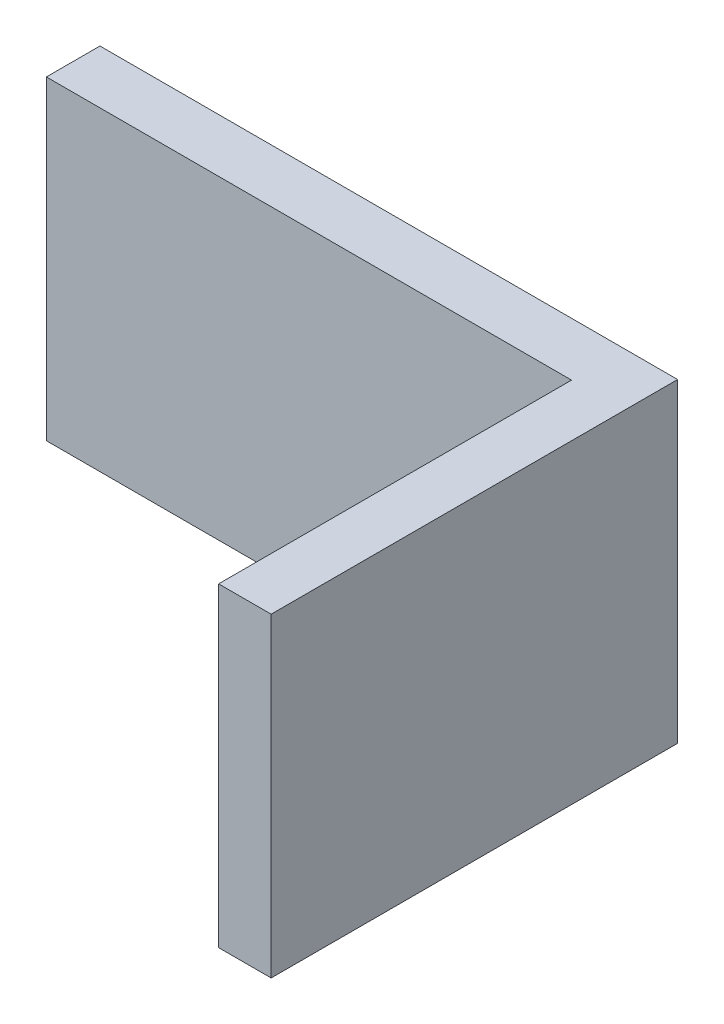
ISO-10303-21;
HEADER;
FILE_DESCRIPTION(('STEP AP214'),'2;1');
FILE_NAME('part.step','',(''),(''),'','','');
FILE_SCHEMA(('AUTOMOTIVE_DESIGN { 1 0 10303 214 1 1 1 1 }'));
ENDSEC;
DATA;
#1=APPLICATION_CONTEXT('core data for automotive mechanical design processes');
#2=APPLICATION_PROTOCOL_DEFINITION('international standard','automotive_design',2000,#1);
#3=PRODUCT_CONTEXT('',#1,'mechanical');
#4=PRODUCT('Part','Part','',(#3));
#5=PRODUCT_RELATED_PRODUCT_CATEGORY('part','',(#4));
#6=PRODUCT_DEFINITION_FORMATION('','',#4);
#7=PRODUCT_DEFINITION_CONTEXT('part definition',#1,'design');
#8=PRODUCT_DEFINITION('design','',#6,#7);
#9=PRODUCT_DEFINITION_SHAPE('','',#8);
#10=(LENGTH_UNIT() NAMED_UNIT(*) SI_UNIT(.MILLI.,.METRE.));
#11=(NAMED_UNIT(*) PLANE_ANGLE_UNIT() SI_UNIT($,.RADIAN.));
#12=(NAMED_UNIT(*) SI_UNIT($,.STERADIAN.) SOLID_ANGLE_UNIT());
#13=UNCERTAINTY_MEASURE_WITH_UNIT(LENGTH_MEASURE(1.E-05),#10,'distance_accuracy_value','');
#14=(GEOMETRIC_REPRESENTATION_CONTEXT(3) GLOBAL_UNCERTAINTY_ASSIGNED_CONTEXT((#13)) GLOBAL_UNIT_ASSIGNED_CONTEXT((#10,
#11,#12)) REPRESENTATION_CONTEXT('',''));
#15=CARTESIAN_POINT('',(0.,0.,0.));
#16=DIRECTION('',(0.,0.,1.));
#17=DIRECTION('',(1.,0.,0.));
#18=AXIS2_PLACEMENT_3D('',#15,#16,#17);
#19=CARTESIAN_POINT('',(4.55,-3.1,0.));
#20=DIRECTION('',(0.,1.,0.));
#21=DIRECTION('',(0.,0.,1.));
#22=AXIS2_PLACEMENT_3D('',#19,#20,#21);
#23=PLANE('',#22);
#24=DIRECTION('',(1.,0.,0.));
#25=VECTOR('',#24,1.);
#26=CARTESIAN_POINT('',(4.,-3.1,0.));
#27=LINE('',#26,#25);
#28=CARTESIAN_POINT('',(4.,-3.1,0.));
#29=VERTEX_POINT('',#28);
#30=CARTESIAN_POINT('',(4.55,-3.1,0.));
#31=VERTEX_POINT('',#30);
#32=EDGE_CURVE('E11',#29,#31,#27,.T.);
#33=ORIENTED_EDGE('',*,*,#32,.F.);
#34=DIRECTION('',(0.,0.,-1.));
#35=VECTOR('',#34,1.);
#36=CARTESIAN_POINT('',(4.,-3.1,0.051));
#37=LINE('',#36,#35);
#38=CARTESIAN_POINT('',(4.,-3.1,0.051));
#39=VERTEX_POINT('',#38);
#40=EDGE_CURVE('E24',#39,#29,#37,.T.);
#41=ORIENTED_EDGE('',*,*,#40,.F.);
#42=DIRECTION('',(-1.,0.,0.));
#43=VECTOR('',#42,1.);
#44=CARTESIAN_POINT('',(4.5,-3.1,0.051));
#45=LINE('',#44,#43);
#46=CARTESIAN_POINT('',(4.5,-3.1,0.051));
#47=VERTEX_POINT('',#46);
#48=EDGE_CURVE('E87',#47,#39,#45,.T.);
#49=ORIENTED_EDGE('',*,*,#48,.F.);
#50=DIRECTION('',(0.,0.,-1.));
#51=VECTOR('',#50,1.);
#52=CARTESIAN_POINT('',(4.5,-3.1,0.387));
#53=LINE('',#52,#51);
#54=CARTESIAN_POINT('',(4.5,-3.1,0.387));
#55=VERTEX_POINT('',#54);
#56=EDGE_CURVE('E114',#55,#47,#53,.T.);
#57=ORIENTED_EDGE('',*,*,#56,.F.);
#58=DIRECTION('',(-1.,0.,0.));
#59=VECTOR('',#58,1.);
#60=CARTESIAN_POINT('',(4.55,-3.1,0.387));
#61=LINE('',#60,#59);
#62=CARTESIAN_POINT('',(4.55,-3.1,0.387));
#63=VERTEX_POINT('',#62);
#64=EDGE_CURVE('E111',#63,#55,#61,.T.);
#65=ORIENTED_EDGE('',*,*,#64,.F.);
#66=DIRECTION('',(0.,0.,1.));
#67=VECTOR('',#66,1.);
#68=CARTESIAN_POINT('',(4.55,-3.1,0.));
#69=LINE('',#68,#67);
#70=EDGE_CURVE('E108',#31,#63,#69,.T.);
#71=ORIENTED_EDGE('',*,*,#70,.F.);
#72=EDGE_LOOP('',(#33,#41,#49,#57,#65,#71));
#73=FACE_BOUND('',#72,.T.);
#74=ADVANCED_FACE('F17',(#73),#23,.T.);
#75=CARTESIAN_POINT('',(4.,-3.4,0.));
#76=DIRECTION('',(0.,-1.,0.));
#77=DIRECTION('',(0.,0.,1.));
#78=AXIS2_PLACEMENT_3D('',#75,#76,#77);
#79=PLANE('',#78);
#80=DIRECTION('',(-1.,0.,0.));
#81=VECTOR('',#80,1.);
#82=CARTESIAN_POINT('',(4.55,-3.4,0.));
#83=LINE('',#82,#81);
#84=CARTESIAN_POINT('',(4.55,-3.4,0.));
#85=VERTEX_POINT('',#84);
#86=CARTESIAN_POINT('',(4.,-3.4,0.));
#87=VERTEX_POINT('',#86);
#88=EDGE_CURVE('E106',#85,#87,#83,.T.);
#89=ORIENTED_EDGE('',*,*,#88,.F.);
#90=DIRECTION('',(0.,0.,-1.));
#91=VECTOR('',#90,1.);
#92=CARTESIAN_POINT('',(4.55,-3.4,0.387));
#93=LINE('',#92,#91);
#94=CARTESIAN_POINT('',(4.55,-3.4,0.387));
#95=VERTEX_POINT('',#94);
#96=EDGE_CURVE('E103',#95,#85,#93,.T.);
#97=ORIENTED_EDGE('',*,*,#96,.F.);
#98=DIRECTION('',(1.,0.,0.));
#99=VECTOR('',#98,1.);
#100=CARTESIAN_POINT('',(4.5,-3.4,0.387));
#101=LINE('',#100,#99);
#102=CARTESIAN_POINT('',(4.5,-3.4,0.387));
#103=VERTEX_POINT('',#102);
#104=EDGE_CURVE('E100',#103,#95,#101,.T.);
#105=ORIENTED_EDGE('',*,*,#104,.F.);
#106=DIRECTION('',(0.,0.,1.));
#107=VECTOR('',#106,1.);
#108=CARTESIAN_POINT('',(4.5,-3.4,0.051));
#109=LINE('',#108,#107);
#110=CARTESIAN_POINT('',(4.5,-3.4,0.051));
#111=VERTEX_POINT('',#110);
#112=EDGE_CURVE('E72',#111,#103,#109,.T.);
#113=ORIENTED_EDGE('',*,*,#112,.F.);
#114=DIRECTION('',(1.,0.,0.));
#115=VECTOR('',#114,1.);
#116=CARTESIAN_POINT('',(4.,-3.4,0.051));
#117=LINE('',#116,#115);
#118=CARTESIAN_POINT('',(4.,-3.4,0.051));
#119=VERTEX_POINT('',#118);
#120=EDGE_CURVE('E66',#119,#111,#117,.T.);
#121=ORIENTED_EDGE('',*,*,#120,.F.);
#122=DIRECTION('',(0.,0.,1.));
#123=VECTOR('',#122,1.);
#124=CARTESIAN_POINT('',(4.,-3.4,0.));
#125=LINE('',#124,#123);
#126=EDGE_CURVE('E69',#87,#119,#125,.T.);
#127=ORIENTED_EDGE('',*,*,#126,.F.);
#128=EDGE_LOOP('',(#89,#97,#105,#113,#121,#127));
#129=FACE_BOUND('',#128,.T.);
#130=ADVANCED_FACE('F68',(#129),#79,.T.);
#131=CARTESIAN_POINT('',(4.55,-3.1,0.387));
#132=DIRECTION('',(0.,0.,1.));
#133=DIRECTION('',(0.,1.,0.));
#134=AXIS2_PLACEMENT_3D('',#131,#132,#133);
#135=PLANE('',#134);
#136=ORIENTED_EDGE('',*,*,#64,.T.);
#137=DIRECTION('',(0.,1.,0.));
#138=VECTOR('',#137,1.);
#139=CARTESIAN_POINT('',(4.5,-3.4,0.387));
#140=LINE('',#139,#138);
#141=EDGE_CURVE('E83',#103,#55,#140,.T.);
#142=ORIENTED_EDGE('',*,*,#141,.F.);
#143=ORIENTED_EDGE('',*,*,#104,.T.);
#144=DIRECTION('',(0.,-1.,0.));
#145=VECTOR('',#144,1.);
#146=CARTESIAN_POINT('',(4.55,-3.1,0.387));
#147=LINE('',#146,#145);
#148=EDGE_CURVE('E88',#63,#95,#147,.T.);
#149=ORIENTED_EDGE('',*,*,#148,.F.);
#150=EDGE_LOOP('',(#136,#142,#143,#149));
#151=FACE_BOUND('',#150,.T.);
#152=ADVANCED_FACE('F125',(#151),#135,.T.);
#153=CARTESIAN_POINT('',(4.5,-3.1,0.051));
#154=DIRECTION('',(0.,0.,1.));
#155=DIRECTION('',(0.,1.,0.));
#156=AXIS2_PLACEMENT_3D('',#153,#154,#155);
#157=PLANE('',#156);
#158=ORIENTED_EDGE('',*,*,#48,.T.);
#159=DIRECTION('',(0.,1.,0.));
#160=VECTOR('',#159,1.);
#161=CARTESIAN_POINT('',(4.,-3.4,0.051));
#162=LINE('',#161,#160);
#163=EDGE_CURVE('E81',#119,#39,#162,.T.);
#164=ORIENTED_EDGE('',*,*,#163,.F.);
#165=ORIENTED_EDGE('',*,*,#120,.T.);
#166=DIRECTION('',(0.,-1.,0.));
#167=VECTOR('',#166,1.);
#168=CARTESIAN_POINT('',(4.5,-3.1,0.051));
#169=LINE('',#168,#167);
#170=EDGE_CURVE('E89',#47,#111,#169,.T.);
#171=ORIENTED_EDGE('',*,*,#170,.F.);
#172=EDGE_LOOP('',(#158,#164,#165,#171));
#173=FACE_BOUND('',#172,.T.);
#174=ADVANCED_FACE('F86',(#173),#157,.T.);
#175=CARTESIAN_POINT('',(4.55,-3.4,0.));
#176=DIRECTION('',(1.,0.,0.));
#177=DIRECTION('',(0.,0.,1.));
#178=AXIS2_PLACEMENT_3D('',#175,#176,#177);
#179=PLANE('',#178);
#180=DIRECTION('',(0.,-1.,0.));
#181=VECTOR('',#180,1.);
#182=CARTESIAN_POINT('',(4.55,-3.1,0.));
#183=LINE('',#182,#181);
#184=EDGE_CURVE('E93',#31,#85,#183,.T.);
#185=ORIENTED_EDGE('',*,*,#184,.F.);
#186=ORIENTED_EDGE('',*,*,#70,.T.);
#187=ORIENTED_EDGE('',*,*,#148,.T.);
#188=ORIENTED_EDGE('',*,*,#96,.T.);
#189=EDGE_LOOP('',(#185,#186,#187,#188));
#190=FACE_BOUND('',#189,.T.);
#191=ADVANCED_FACE('F121',(#190),#179,.T.);
#192=CARTESIAN_POINT('',(4.,-3.1,0.));
#193=DIRECTION('',(-1.,0.,0.));
#194=DIRECTION('',(0.,0.,1.));
#195=AXIS2_PLACEMENT_3D('',#192,#193,#194);
#196=PLANE('',#195);
#197=DIRECTION('',(0.,1.,0.));
#198=VECTOR('',#197,1.);
#199=CARTESIAN_POINT('',(4.,-3.4,0.));
#200=LINE('',#199,#198);
#201=EDGE_CURVE('E82',#87,#29,#200,.T.);
#202=ORIENTED_EDGE('',*,*,#201,.F.);
#203=ORIENTED_EDGE('',*,*,#126,.T.);
#204=ORIENTED_EDGE('',*,*,#163,.T.);
#205=ORIENTED_EDGE('',*,*,#40,.T.);
#206=EDGE_LOOP('',(#202,#203,#204,#205));
#207=FACE_BOUND('',#206,.T.);
#208=ADVANCED_FACE('F80',(#207),#196,.T.);
#209=CARTESIAN_POINT('',(4.5,-3.1,0.051));
#210=DIRECTION('',(-1.,0.,0.));
#211=DIRECTION('',(0.,0.,1.));
#212=AXIS2_PLACEMENT_3D('',#209,#210,#211);
#213=PLANE('',#212);
#214=ORIENTED_EDGE('',*,*,#170,.T.);
#215=ORIENTED_EDGE('',*,*,#112,.T.);
#216=ORIENTED_EDGE('',*,*,#141,.T.);
#217=ORIENTED_EDGE('',*,*,#56,.T.);
#218=EDGE_LOOP('',(#214,#215,#216,#217));
#219=FACE_BOUND('',#218,.T.);
#220=ADVANCED_FACE('F127',(#219),#213,.T.);
#221=CARTESIAN_POINT('',(4.55,-3.4,0.));
#222=DIRECTION('',(0.,0.,-1.));
#223=DIRECTION('',(0.,1.,0.));
#224=AXIS2_PLACEMENT_3D('',#221,#222,#223);
#225=PLANE('',#224);
#226=ORIENTED_EDGE('',*,*,#88,.T.);
#227=ORIENTED_EDGE('',*,*,#201,.T.);
#228=ORIENTED_EDGE('',*,*,#32,.T.);
#229=ORIENTED_EDGE('',*,*,#184,.T.);
#230=EDGE_LOOP('',(#226,#227,#228,#229));
#231=FACE_BOUND('',#230,.T.);
#232=ADVANCED_FACE('F117',(#231),#225,.T.);
#233=CLOSED_SHELL('',(#74,#130,#152,#174,#191,#208,#220,#232));
#234=MANIFOLD_SOLID_BREP('B1',#233);
#235=ADVANCED_BREP_SHAPE_REPRESENTATION('',(#18,#234),#14);
#236=SHAPE_DEFINITION_REPRESENTATION(#9,#235);
ENDSEC;
END-ISO-10303-21;
